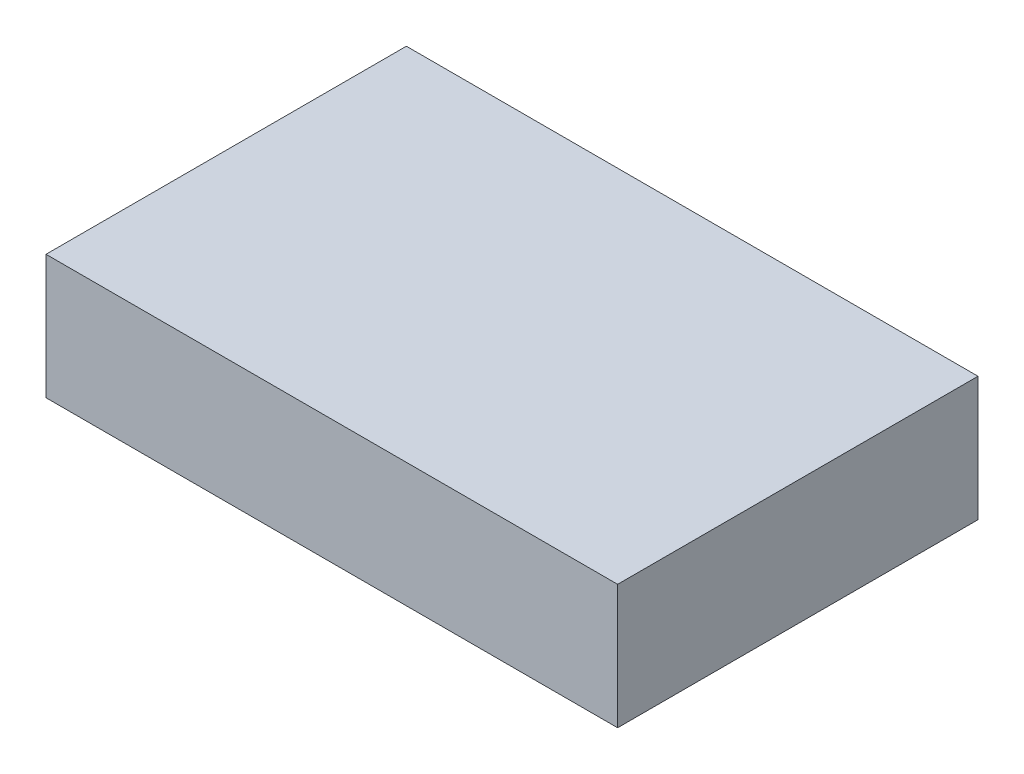
ISO-10303-21;
HEADER;
FILE_DESCRIPTION(('STEP AP214'),'2;1');
FILE_NAME('part.step','',(''),(''),'','','');
FILE_SCHEMA(('AUTOMOTIVE_DESIGN { 1 0 10303 214 1 1 1 1 }'));
ENDSEC;
DATA;
#1=APPLICATION_CONTEXT('core data for automotive mechanical design processes');
#2=APPLICATION_PROTOCOL_DEFINITION('international standard','automotive_design',2000,#1);
#3=PRODUCT_CONTEXT('',#1,'mechanical');
#4=PRODUCT('Part','Part','',(#3));
#5=PRODUCT_RELATED_PRODUCT_CATEGORY('part','',(#4));
#6=PRODUCT_DEFINITION_FORMATION('','',#4);
#7=PRODUCT_DEFINITION_CONTEXT('part definition',#1,'design');
#8=PRODUCT_DEFINITION('design','',#6,#7);
#9=PRODUCT_DEFINITION_SHAPE('','',#8);
#10=(LENGTH_UNIT() NAMED_UNIT(*) SI_UNIT(.MILLI.,.METRE.));
#11=(NAMED_UNIT(*) PLANE_ANGLE_UNIT() SI_UNIT($,.RADIAN.));
#12=(NAMED_UNIT(*) SI_UNIT($,.STERADIAN.) SOLID_ANGLE_UNIT());
#13=UNCERTAINTY_MEASURE_WITH_UNIT(LENGTH_MEASURE(1.E-05),#10,'distance_accuracy_value','');
#14=(GEOMETRIC_REPRESENTATION_CONTEXT(3) GLOBAL_UNCERTAINTY_ASSIGNED_CONTEXT((#13)) GLOBAL_UNIT_ASSIGNED_CONTEXT((#10,
#11,#12)) REPRESENTATION_CONTEXT('',''));
#15=CARTESIAN_POINT('',(0.,0.,0.));
#16=DIRECTION('',(0.,0.,1.));
#17=DIRECTION('',(1.,0.,0.));
#18=AXIS2_PLACEMENT_3D('',#15,#16,#17);
#19=CARTESIAN_POINT('',(0.,12.7,0.));
#20=DIRECTION('',(1.,0.,0.));
#21=DIRECTION('',(0.,0.,-1.));
#22=AXIS2_PLACEMENT_3D('',#19,#20,#21);
#23=PLANE('',#22);
#24=DIRECTION('',(0.,0.,1.));
#25=VECTOR('',#24,1.);
#26=CARTESIAN_POINT('',(0.,0.,0.));
#27=LINE('',#26,#25);
#28=CARTESIAN_POINT('',(0.,0.,-36.83));
#29=VERTEX_POINT('',#28);
#30=CARTESIAN_POINT('',(0.,0.,0.));
#31=VERTEX_POINT('',#30);
#32=EDGE_CURVE('E96',#29,#31,#27,.T.);
#33=ORIENTED_EDGE('',*,*,#32,.T.);
#34=DIRECTION('',(0.,-1.,0.));
#35=VECTOR('',#34,1.);
#36=CARTESIAN_POINT('',(0.,12.7,0.));
#37=LINE('',#36,#35);
#38=CARTESIAN_POINT('',(0.,12.7,0.));
#39=VERTEX_POINT('',#38);
#40=EDGE_CURVE('E11',#39,#31,#37,.T.);
#41=ORIENTED_EDGE('',*,*,#40,.F.);
#42=DIRECTION('',(0.,0.,1.));
#43=VECTOR('',#42,1.);
#44=CARTESIAN_POINT('',(0.,12.7,0.));
#45=LINE('',#44,#43);
#46=CARTESIAN_POINT('',(0.,12.7,-36.83));
#47=VERTEX_POINT('',#46);
#48=EDGE_CURVE('E84',#47,#39,#45,.T.);
#49=ORIENTED_EDGE('',*,*,#48,.F.);
#50=DIRECTION('',(0.,-1.,0.));
#51=VECTOR('',#50,1.);
#52=CARTESIAN_POINT('',(0.,12.7,-36.83));
#53=LINE('',#52,#51);
#54=EDGE_CURVE('E92',#47,#29,#53,.T.);
#55=ORIENTED_EDGE('',*,*,#54,.T.);
#56=EDGE_LOOP('',(#33,#41,#49,#55));
#57=FACE_BOUND('',#56,.T.);
#58=ADVANCED_FACE('F33',(#57),#23,.F.);
#59=CARTESIAN_POINT('',(0.,12.7,0.));
#60=DIRECTION('',(0.,0.,-1.));
#61=DIRECTION('',(-1.,0.,0.));
#62=AXIS2_PLACEMENT_3D('',#59,#60,#61);
#63=PLANE('',#62);
#64=DIRECTION('',(1.,0.,0.));
#65=VECTOR('',#64,1.);
#66=CARTESIAN_POINT('',(0.,0.,0.));
#67=LINE('',#66,#65);
#68=CARTESIAN_POINT('',(58.42,0.,0.));
#69=VERTEX_POINT('',#68);
#70=EDGE_CURVE('E88',#31,#69,#67,.T.);
#71=ORIENTED_EDGE('',*,*,#70,.T.);
#72=DIRECTION('',(0.,-1.,0.));
#73=VECTOR('',#72,1.);
#74=CARTESIAN_POINT('',(58.42,12.7,0.));
#75=LINE('',#74,#73);
#76=CARTESIAN_POINT('',(58.42,12.7,0.));
#77=VERTEX_POINT('',#76);
#78=EDGE_CURVE('E41',#77,#69,#75,.T.);
#79=ORIENTED_EDGE('',*,*,#78,.F.);
#80=DIRECTION('',(1.,0.,0.));
#81=VECTOR('',#80,1.);
#82=CARTESIAN_POINT('',(0.,12.7,0.));
#83=LINE('',#82,#81);
#84=EDGE_CURVE('E79',#39,#77,#83,.T.);
#85=ORIENTED_EDGE('',*,*,#84,.F.);
#86=ORIENTED_EDGE('',*,*,#40,.T.);
#87=EDGE_LOOP('',(#71,#79,#85,#86));
#88=FACE_BOUND('',#87,.T.);
#89=ADVANCED_FACE('F87',(#88),#63,.F.);
#90=CARTESIAN_POINT('',(58.42,12.7,0.));
#91=DIRECTION('',(-1.,0.,0.));
#92=DIRECTION('',(0.,0.,1.));
#93=AXIS2_PLACEMENT_3D('',#90,#91,#92);
#94=PLANE('',#93);
#95=DIRECTION('',(0.,0.,-1.));
#96=VECTOR('',#95,1.);
#97=CARTESIAN_POINT('',(58.42,0.,0.));
#98=LINE('',#97,#96);
#99=CARTESIAN_POINT('',(58.42,0.,-36.83));
#100=VERTEX_POINT('',#99);
#101=EDGE_CURVE('E66',#69,#100,#98,.T.);
#102=ORIENTED_EDGE('',*,*,#101,.T.);
#103=DIRECTION('',(0.,-1.,0.));
#104=VECTOR('',#103,1.);
#105=CARTESIAN_POINT('',(58.42,12.7,-36.83));
#106=LINE('',#105,#104);
#107=CARTESIAN_POINT('',(58.42,12.7,-36.83));
#108=VERTEX_POINT('',#107);
#109=EDGE_CURVE('E89',#108,#100,#106,.T.);
#110=ORIENTED_EDGE('',*,*,#109,.F.);
#111=DIRECTION('',(0.,0.,-1.));
#112=VECTOR('',#111,1.);
#113=CARTESIAN_POINT('',(58.42,12.7,0.));
#114=LINE('',#113,#112);
#115=EDGE_CURVE('E82',#77,#108,#114,.T.);
#116=ORIENTED_EDGE('',*,*,#115,.F.);
#117=ORIENTED_EDGE('',*,*,#78,.T.);
#118=EDGE_LOOP('',(#102,#110,#116,#117));
#119=FACE_BOUND('',#118,.T.);
#120=ADVANCED_FACE('F90',(#119),#94,.F.);
#121=CARTESIAN_POINT('',(0.,12.7,-36.83));
#122=DIRECTION('',(0.,0.,1.));
#123=DIRECTION('',(1.,0.,0.));
#124=AXIS2_PLACEMENT_3D('',#121,#122,#123);
#125=PLANE('',#124);
#126=DIRECTION('',(-1.,0.,0.));
#127=VECTOR('',#126,1.);
#128=CARTESIAN_POINT('',(0.,0.,-36.83));
#129=LINE('',#128,#127);
#130=EDGE_CURVE('E72',#100,#29,#129,.T.);
#131=ORIENTED_EDGE('',*,*,#130,.T.);
#132=ORIENTED_EDGE('',*,*,#54,.F.);
#133=DIRECTION('',(-1.,0.,0.));
#134=VECTOR('',#133,1.);
#135=CARTESIAN_POINT('',(0.,12.7,-36.83));
#136=LINE('',#135,#134);
#137=EDGE_CURVE('E49',#108,#47,#136,.T.);
#138=ORIENTED_EDGE('',*,*,#137,.F.);
#139=ORIENTED_EDGE('',*,*,#109,.T.);
#140=EDGE_LOOP('',(#131,#132,#138,#139));
#141=FACE_BOUND('',#140,.T.);
#142=ADVANCED_FACE('F103',(#141),#125,.F.);
#143=CARTESIAN_POINT('',(0.,12.7,0.));
#144=DIRECTION('',(0.,-1.,0.));
#145=DIRECTION('',(0.,0.,-1.));
#146=AXIS2_PLACEMENT_3D('',#143,#144,#145);
#147=PLANE('',#146);
#148=ORIENTED_EDGE('',*,*,#48,.T.);
#149=ORIENTED_EDGE('',*,*,#84,.T.);
#150=ORIENTED_EDGE('',*,*,#115,.T.);
#151=ORIENTED_EDGE('',*,*,#137,.T.);
#152=EDGE_LOOP('',(#148,#149,#150,#151));
#153=FACE_BOUND('',#152,.T.);
#154=ADVANCED_FACE('F80',(#153),#147,.F.);
#155=CARTESIAN_POINT('',(0.,0.,0.));
#156=DIRECTION('',(0.,-1.,0.));
#157=DIRECTION('',(0.,0.,-1.));
#158=AXIS2_PLACEMENT_3D('',#155,#156,#157);
#159=PLANE('',#158);
#160=ORIENTED_EDGE('',*,*,#32,.F.);
#161=ORIENTED_EDGE('',*,*,#130,.F.);
#162=ORIENTED_EDGE('',*,*,#101,.F.);
#163=ORIENTED_EDGE('',*,*,#70,.F.);
#164=EDGE_LOOP('',(#160,#161,#162,#163));
#165=FACE_BOUND('',#164,.T.);
#166=ADVANCED_FACE('F106',(#165),#159,.T.);
#167=CLOSED_SHELL('',(#58,#89,#120,#142,#154,#166));
#168=MANIFOLD_SOLID_BREP('B2',#167);
#169=ADVANCED_BREP_SHAPE_REPRESENTATION('',(#18,#168),#14);
#170=SHAPE_DEFINITION_REPRESENTATION(#9,#169);
ENDSEC;
END-ISO-10303-21;
